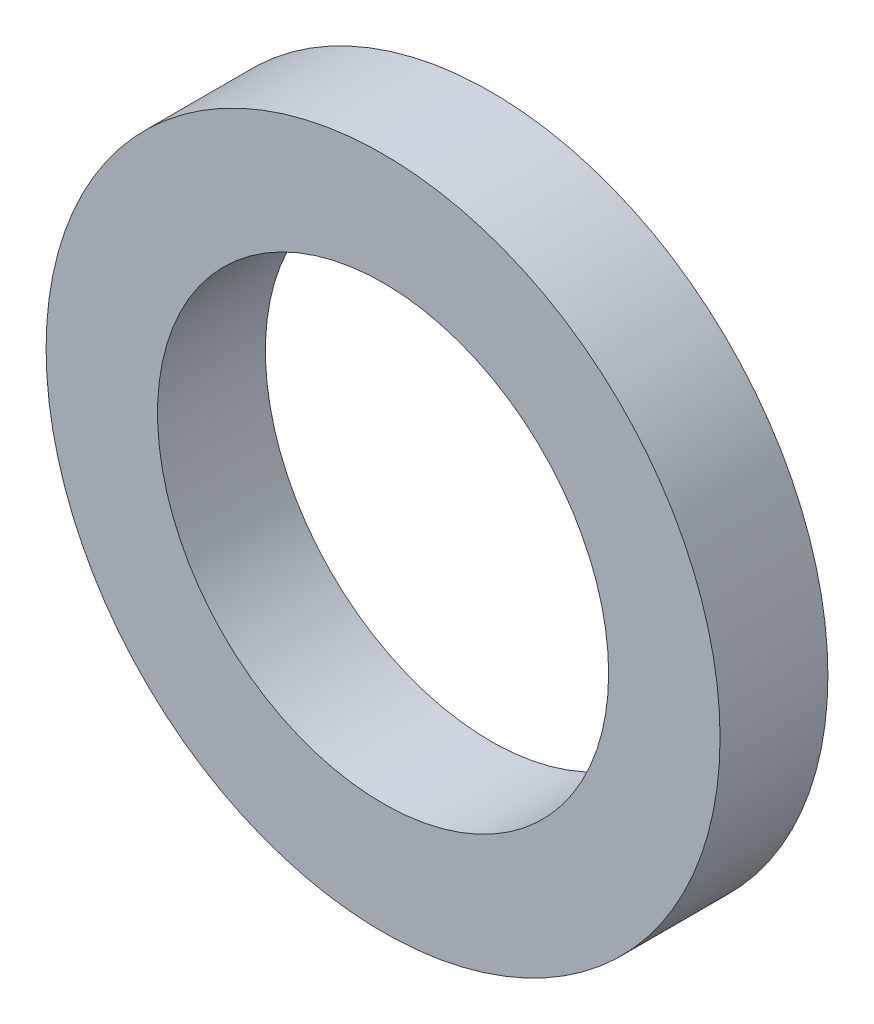
ISO-10303-21;
HEADER;
FILE_DESCRIPTION(('STEP AP214'),'2;1');
FILE_NAME('part.step','',(''),(''),'','','');
FILE_SCHEMA(('AUTOMOTIVE_DESIGN { 1 0 10303 214 1 1 1 1 }'));
ENDSEC;
DATA;
#1=APPLICATION_CONTEXT('core data for automotive mechanical design processes');
#2=APPLICATION_PROTOCOL_DEFINITION('international standard','automotive_design',2000,#1);
#3=PRODUCT_CONTEXT('',#1,'mechanical');
#4=PRODUCT('Part','Part','',(#3));
#5=PRODUCT_RELATED_PRODUCT_CATEGORY('part','',(#4));
#6=PRODUCT_DEFINITION_FORMATION('','',#4);
#7=PRODUCT_DEFINITION_CONTEXT('part definition',#1,'design');
#8=PRODUCT_DEFINITION('design','',#6,#7);
#9=PRODUCT_DEFINITION_SHAPE('','',#8);
#10=(LENGTH_UNIT() NAMED_UNIT(*) SI_UNIT(.MILLI.,.METRE.));
#11=(NAMED_UNIT(*) PLANE_ANGLE_UNIT() SI_UNIT($,.RADIAN.));
#12=(NAMED_UNIT(*) SI_UNIT($,.STERADIAN.) SOLID_ANGLE_UNIT());
#13=UNCERTAINTY_MEASURE_WITH_UNIT(LENGTH_MEASURE(1.E-05),#10,'distance_accuracy_value','');
#14=(GEOMETRIC_REPRESENTATION_CONTEXT(3) GLOBAL_UNCERTAINTY_ASSIGNED_CONTEXT((#13)) GLOBAL_UNIT_ASSIGNED_CONTEXT((#10,
#11,#12)) REPRESENTATION_CONTEXT('',''));
#15=CARTESIAN_POINT('',(0.,0.,0.));
#16=DIRECTION('',(0.,0.,1.));
#17=DIRECTION('',(1.,0.,0.));
#18=AXIS2_PLACEMENT_3D('',#15,#16,#17);
#19=CARTESIAN_POINT('',(0.,0.,1.524));
#20=DIRECTION('',(0.,0.,1.));
#21=DIRECTION('',(1.,0.,0.));
#22=AXIS2_PLACEMENT_3D('',#19,#20,#21);
#23=PLANE('',#22);
#24=CARTESIAN_POINT('',(0.,0.,1.524));
#25=DIRECTION('',(0.,0.,1.));
#26=DIRECTION('',(1.,0.,0.));
#27=AXIS2_PLACEMENT_3D('',#24,#25,#26);
#28=CIRCLE('',#27,4.7625);
#29=CARTESIAN_POINT('',(4.7625,0.,1.524));
#30=VERTEX_POINT('',#29);
#31=EDGE_CURVE('E10',#30,#30,#28,.T.);
#32=ORIENTED_EDGE('',*,*,#31,.T.);
#33=EDGE_LOOP('',(#32));
#34=FACE_BOUND('',#33,.T.);
#35=CARTESIAN_POINT('',(0.,0.,1.524));
#36=DIRECTION('',(0.,0.,1.));
#37=DIRECTION('',(1.,0.,0.));
#38=AXIS2_PLACEMENT_3D('',#35,#36,#37);
#39=CIRCLE('',#38,3.1877);
#40=CARTESIAN_POINT('',(3.1877,0.,1.524));
#41=VERTEX_POINT('',#40);
#42=EDGE_CURVE('E44',#41,#41,#39,.T.);
#43=ORIENTED_EDGE('',*,*,#42,.F.);
#44=EDGE_LOOP('',(#43));
#45=FACE_BOUND('',#44,.T.);
#46=ADVANCED_FACE('F33',(#34,#45),#23,.T.);
#47=CARTESIAN_POINT('',(0.,0.,0.));
#48=DIRECTION('',(0.,0.,1.));
#49=DIRECTION('',(1.,0.,0.));
#50=AXIS2_PLACEMENT_3D('',#47,#48,#49);
#51=PLANE('',#50);
#52=CARTESIAN_POINT('',(0.,0.,0.));
#53=DIRECTION('',(0.,0.,1.));
#54=DIRECTION('',(1.,0.,0.));
#55=AXIS2_PLACEMENT_3D('',#52,#53,#54);
#56=CIRCLE('',#55,4.7625);
#57=CARTESIAN_POINT('',(4.7625,0.,0.));
#58=VERTEX_POINT('',#57);
#59=EDGE_CURVE('E37',#58,#58,#56,.T.);
#60=ORIENTED_EDGE('',*,*,#59,.F.);
#61=EDGE_LOOP('',(#60));
#62=FACE_BOUND('',#61,.T.);
#63=CARTESIAN_POINT('',(0.,0.,0.));
#64=DIRECTION('',(0.,0.,1.));
#65=DIRECTION('',(1.,0.,0.));
#66=AXIS2_PLACEMENT_3D('',#63,#64,#65);
#67=CIRCLE('',#66,3.1877);
#68=CARTESIAN_POINT('',(3.1877,0.,0.));
#69=VERTEX_POINT('',#68);
#70=EDGE_CURVE('E46',#69,#69,#67,.T.);
#71=ORIENTED_EDGE('',*,*,#70,.T.);
#72=EDGE_LOOP('',(#71));
#73=FACE_BOUND('',#72,.T.);
#74=ADVANCED_FACE('F56',(#62,#73),#51,.F.);
#75=CARTESIAN_POINT('',(0.,0.,1.524));
#76=DIRECTION('',(0.,0.,-1.));
#77=DIRECTION('',(-1.,0.,0.));
#78=AXIS2_PLACEMENT_3D('',#75,#76,#77);
#79=CYLINDRICAL_SURFACE('',#78,4.7625);
#80=ORIENTED_EDGE('',*,*,#31,.F.);
#81=EDGE_LOOP('',(#80));
#82=FACE_BOUND('',#81,.T.);
#83=ORIENTED_EDGE('',*,*,#59,.T.);
#84=EDGE_LOOP('',(#83));
#85=FACE_BOUND('',#84,.T.);
#86=ADVANCED_FACE('F35',(#82,#85),#79,.T.);
#87=CARTESIAN_POINT('',(0.,0.,1.524));
#88=DIRECTION('',(0.,0.,-1.));
#89=DIRECTION('',(-1.,0.,0.));
#90=AXIS2_PLACEMENT_3D('',#87,#88,#89);
#91=CYLINDRICAL_SURFACE('',#90,3.1877);
#92=ORIENTED_EDGE('',*,*,#42,.T.);
#93=EDGE_LOOP('',(#92));
#94=FACE_BOUND('',#93,.T.);
#95=ORIENTED_EDGE('',*,*,#70,.F.);
#96=EDGE_LOOP('',(#95));
#97=FACE_BOUND('',#96,.T.);
#98=ADVANCED_FACE('F52',(#94,#97),#91,.F.);
#99=CLOSED_SHELL('',(#46,#74,#86,#98));
#100=MANIFOLD_SOLID_BREP('B2',#99);
#101=ADVANCED_BREP_SHAPE_REPRESENTATION('',(#18,#100),#14);
#102=SHAPE_DEFINITION_REPRESENTATION(#9,#101);
ENDSEC;
END-ISO-10303-21;
